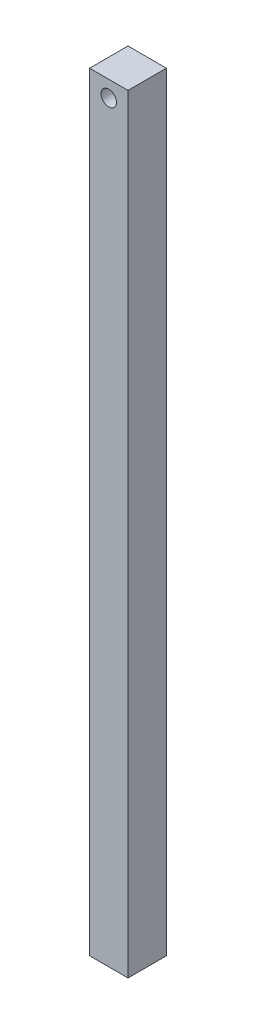
ISO-10303-21;
HEADER;
FILE_DESCRIPTION(('STEP AP214'),'2;1');
FILE_NAME('part.step','',(''),(''),'','','');
FILE_SCHEMA(('AUTOMOTIVE_DESIGN { 1 0 10303 214 1 1 1 1 }'));
ENDSEC;
DATA;
#1=APPLICATION_CONTEXT('core data for automotive mechanical design processes');
#2=APPLICATION_PROTOCOL_DEFINITION('international standard','automotive_design',2000,#1);
#3=PRODUCT_CONTEXT('',#1,'mechanical');
#4=PRODUCT('Part','Part','',(#3));
#5=PRODUCT_RELATED_PRODUCT_CATEGORY('part','',(#4));
#6=PRODUCT_DEFINITION_FORMATION('','',#4);
#7=PRODUCT_DEFINITION_CONTEXT('part definition',#1,'design');
#8=PRODUCT_DEFINITION('design','',#6,#7);
#9=PRODUCT_DEFINITION_SHAPE('','',#8);
#10=(LENGTH_UNIT() NAMED_UNIT(*) SI_UNIT(.MILLI.,.METRE.));
#11=(NAMED_UNIT(*) PLANE_ANGLE_UNIT() SI_UNIT($,.RADIAN.));
#12=(NAMED_UNIT(*) SI_UNIT($,.STERADIAN.) SOLID_ANGLE_UNIT());
#13=UNCERTAINTY_MEASURE_WITH_UNIT(LENGTH_MEASURE(1.E-05),#10,'distance_accuracy_value','');
#14=(GEOMETRIC_REPRESENTATION_CONTEXT(3) GLOBAL_UNCERTAINTY_ASSIGNED_CONTEXT((#13)) GLOBAL_UNIT_ASSIGNED_CONTEXT((#10,
#11,#12)) REPRESENTATION_CONTEXT('',''));
#15=CARTESIAN_POINT('',(0.,0.,0.));
#16=DIRECTION('',(0.,0.,1.));
#17=DIRECTION('',(1.,0.,0.));
#18=AXIS2_PLACEMENT_3D('',#15,#16,#17);
#19=CARTESIAN_POINT('',(2.49999999999999,50.,5.));
#20=DIRECTION('',(-1.,0.,0.));
#21=DIRECTION('',(0.,-1.,0.));
#22=AXIS2_PLACEMENT_3D('',#19,#20,#21);
#23=PLANE('',#22);
#24=DIRECTION('',(0.,1.,0.));
#25=VECTOR('',#24,1.);
#26=CARTESIAN_POINT('',(2.49999999999999,50.,0.));
#27=LINE('',#26,#25);
#28=CARTESIAN_POINT('',(2.50000000000001,-50.,0.));
#29=VERTEX_POINT('',#28);
#30=CARTESIAN_POINT('',(2.49999999999999,50.,0.));
#31=VERTEX_POINT('',#30);
#32=EDGE_CURVE('E96',#29,#31,#27,.T.);
#33=ORIENTED_EDGE('',*,*,#32,.T.);
#34=DIRECTION('',(0.,0.,-1.));
#35=VECTOR('',#34,1.);
#36=CARTESIAN_POINT('',(2.49999999999999,50.,5.));
#37=LINE('',#36,#35);
#38=CARTESIAN_POINT('',(2.49999999999999,50.,5.));
#39=VERTEX_POINT('',#38);
#40=EDGE_CURVE('E11',#39,#31,#37,.T.);
#41=ORIENTED_EDGE('',*,*,#40,.F.);
#42=DIRECTION('',(0.,1.,0.));
#43=VECTOR('',#42,1.);
#44=CARTESIAN_POINT('',(2.49999999999999,50.,5.));
#45=LINE('',#44,#43);
#46=CARTESIAN_POINT('',(2.50000000000001,-50.,5.));
#47=VERTEX_POINT('',#46);
#48=EDGE_CURVE('E84',#47,#39,#45,.T.);
#49=ORIENTED_EDGE('',*,*,#48,.F.);
#50=DIRECTION('',(0.,0.,-1.));
#51=VECTOR('',#50,1.);
#52=CARTESIAN_POINT('',(2.50000000000001,-50.,5.));
#53=LINE('',#52,#51);
#54=EDGE_CURVE('E92',#47,#29,#53,.T.);
#55=ORIENTED_EDGE('',*,*,#54,.T.);
#56=EDGE_LOOP('',(#33,#41,#49,#55));
#57=FACE_BOUND('',#56,.T.);
#58=ADVANCED_FACE('F33',(#57),#23,.F.);
#59=CARTESIAN_POINT('',(-2.50000000000001,50.,5.));
#60=DIRECTION('',(0.,-1.,0.));
#61=DIRECTION('',(0.,0.,-1.));
#62=AXIS2_PLACEMENT_3D('',#59,#60,#61);
#63=PLANE('',#62);
#64=DIRECTION('',(-1.,0.,0.));
#65=VECTOR('',#64,1.);
#66=CARTESIAN_POINT('',(-2.50000000000001,50.,0.));
#67=LINE('',#66,#65);
#68=CARTESIAN_POINT('',(-2.50000000000001,50.,0.));
#69=VERTEX_POINT('',#68);
#70=EDGE_CURVE('E88',#31,#69,#67,.T.);
#71=ORIENTED_EDGE('',*,*,#70,.T.);
#72=DIRECTION('',(0.,0.,-1.));
#73=VECTOR('',#72,1.);
#74=CARTESIAN_POINT('',(-2.50000000000001,50.,5.));
#75=LINE('',#74,#73);
#76=CARTESIAN_POINT('',(-2.50000000000001,50.,5.));
#77=VERTEX_POINT('',#76);
#78=EDGE_CURVE('E41',#77,#69,#75,.T.);
#79=ORIENTED_EDGE('',*,*,#78,.F.);
#80=DIRECTION('',(-1.,0.,0.));
#81=VECTOR('',#80,1.);
#82=CARTESIAN_POINT('',(-2.50000000000001,50.,5.));
#83=LINE('',#82,#81);
#84=EDGE_CURVE('E79',#39,#77,#83,.T.);
#85=ORIENTED_EDGE('',*,*,#84,.F.);
#86=ORIENTED_EDGE('',*,*,#40,.T.);
#87=EDGE_LOOP('',(#71,#79,#85,#86));
#88=FACE_BOUND('',#87,.T.);
#89=ADVANCED_FACE('F87',(#88),#63,.F.);
#90=CARTESIAN_POINT('',(-2.50000000000001,50.,5.));
#91=DIRECTION('',(1.,0.,0.));
#92=DIRECTION('',(0.,1.,0.));
#93=AXIS2_PLACEMENT_3D('',#90,#91,#92);
#94=PLANE('',#93);
#95=DIRECTION('',(0.,-1.,0.));
#96=VECTOR('',#95,1.);
#97=CARTESIAN_POINT('',(-2.50000000000001,50.,0.));
#98=LINE('',#97,#96);
#99=CARTESIAN_POINT('',(-2.49999999999999,-50.,0.));
#100=VERTEX_POINT('',#99);
#101=EDGE_CURVE('E66',#69,#100,#98,.T.);
#102=ORIENTED_EDGE('',*,*,#101,.T.);
#103=DIRECTION('',(0.,0.,-1.));
#104=VECTOR('',#103,1.);
#105=CARTESIAN_POINT('',(-2.49999999999999,-50.,5.));
#106=LINE('',#105,#104);
#107=CARTESIAN_POINT('',(-2.49999999999999,-50.,5.));
#108=VERTEX_POINT('',#107);
#109=EDGE_CURVE('E89',#108,#100,#106,.T.);
#110=ORIENTED_EDGE('',*,*,#109,.F.);
#111=DIRECTION('',(0.,-1.,0.));
#112=VECTOR('',#111,1.);
#113=CARTESIAN_POINT('',(-2.50000000000001,50.,5.));
#114=LINE('',#113,#112);
#115=EDGE_CURVE('E82',#77,#108,#114,.T.);
#116=ORIENTED_EDGE('',*,*,#115,.F.);
#117=ORIENTED_EDGE('',*,*,#78,.T.);
#118=EDGE_LOOP('',(#102,#110,#116,#117));
#119=FACE_BOUND('',#118,.T.);
#120=ADVANCED_FACE('F90',(#119),#94,.F.);
#121=CARTESIAN_POINT('',(-2.49999999999999,-50.,5.));
#122=DIRECTION('',(0.,1.,0.));
#123=DIRECTION('',(0.,0.,1.));
#124=AXIS2_PLACEMENT_3D('',#121,#122,#123);
#125=PLANE('',#124);
#126=DIRECTION('',(1.,0.,0.));
#127=VECTOR('',#126,1.);
#128=CARTESIAN_POINT('',(-2.49999999999999,-50.,0.));
#129=LINE('',#128,#127);
#130=EDGE_CURVE('E72',#100,#29,#129,.T.);
#131=ORIENTED_EDGE('',*,*,#130,.T.);
#132=ORIENTED_EDGE('',*,*,#54,.F.);
#133=DIRECTION('',(1.,0.,0.));
#134=VECTOR('',#133,1.);
#135=CARTESIAN_POINT('',(-2.49999999999999,-50.,5.));
#136=LINE('',#135,#134);
#137=EDGE_CURVE('E49',#108,#47,#136,.T.);
#138=ORIENTED_EDGE('',*,*,#137,.F.);
#139=ORIENTED_EDGE('',*,*,#109,.T.);
#140=EDGE_LOOP('',(#131,#132,#138,#139));
#141=FACE_BOUND('',#140,.T.);
#142=ADVANCED_FACE('F104',(#141),#125,.F.);
#143=CARTESIAN_POINT('',(0.,0.,5.));
#144=DIRECTION('',(0.,0.,1.));
#145=DIRECTION('',(1.,0.,0.));
#146=AXIS2_PLACEMENT_3D('',#143,#144,#145);
#147=PLANE('',#146);
#148=CARTESIAN_POINT('',(0.,47.8849657787944,5.));
#149=DIRECTION('',(0.,0.,1.));
#150=DIRECTION('',(1.,0.,0.));
#151=AXIS2_PLACEMENT_3D('',#148,#149,#150);
#152=CIRCLE('',#151,1.);
#153=CARTESIAN_POINT('',(1.,47.8849657787944,5.));
#154=VERTEX_POINT('',#153);
#155=EDGE_CURVE('E110',#154,#154,#152,.T.);
#156=ORIENTED_EDGE('',*,*,#155,.F.);
#157=EDGE_LOOP('',(#156));
#158=FACE_BOUND('',#157,.T.);
#159=ORIENTED_EDGE('',*,*,#48,.T.);
#160=ORIENTED_EDGE('',*,*,#84,.T.);
#161=ORIENTED_EDGE('',*,*,#115,.T.);
#162=ORIENTED_EDGE('',*,*,#137,.T.);
#163=EDGE_LOOP('',(#159,#160,#161,#162));
#164=FACE_BOUND('',#163,.T.);
#165=ADVANCED_FACE('F80',(#158,#164),#147,.T.);
#166=CARTESIAN_POINT('',(0.,0.,0.));
#167=DIRECTION('',(0.,0.,1.));
#168=DIRECTION('',(1.,0.,0.));
#169=AXIS2_PLACEMENT_3D('',#166,#167,#168);
#170=PLANE('',#169);
#171=CARTESIAN_POINT('',(0.,47.8849657787944,0.));
#172=DIRECTION('',(0.,0.,1.));
#173=DIRECTION('',(1.,0.,0.));
#174=AXIS2_PLACEMENT_3D('',#171,#172,#173);
#175=CIRCLE('',#174,1.);
#176=CARTESIAN_POINT('',(1.,47.8849657787944,0.));
#177=VERTEX_POINT('',#176);
#178=EDGE_CURVE('E99',#177,#177,#175,.T.);
#179=ORIENTED_EDGE('',*,*,#178,.T.);
#180=EDGE_LOOP('',(#179));
#181=FACE_BOUND('',#180,.T.);
#182=ORIENTED_EDGE('',*,*,#32,.F.);
#183=ORIENTED_EDGE('',*,*,#130,.F.);
#184=ORIENTED_EDGE('',*,*,#101,.F.);
#185=ORIENTED_EDGE('',*,*,#70,.F.);
#186=EDGE_LOOP('',(#182,#183,#184,#185));
#187=FACE_BOUND('',#186,.T.);
#188=ADVANCED_FACE('F107',(#181,#187),#170,.F.);
#189=CARTESIAN_POINT('',(0.,47.8849657787944,0.));
#190=DIRECTION('',(0.,0.,1.));
#191=DIRECTION('',(1.,0.,0.));
#192=AXIS2_PLACEMENT_3D('',#189,#190,#191);
#193=CYLINDRICAL_SURFACE('',#192,1.);
#194=ORIENTED_EDGE('',*,*,#178,.F.);
#195=EDGE_LOOP('',(#194));
#196=FACE_BOUND('',#195,.T.);
#197=ORIENTED_EDGE('',*,*,#155,.T.);
#198=EDGE_LOOP('',(#197));
#199=FACE_BOUND('',#198,.T.);
#200=ADVANCED_FACE('F117',(#196,#199),#193,.F.);
#201=CLOSED_SHELL('',(#58,#89,#120,#142,#165,#188,#200));
#202=MANIFOLD_SOLID_BREP('B2',#201);
#203=ADVANCED_BREP_SHAPE_REPRESENTATION('',(#18,#202),#14);
#204=SHAPE_DEFINITION_REPRESENTATION(#9,#203);
ENDSEC;
END-ISO-10303-21;
